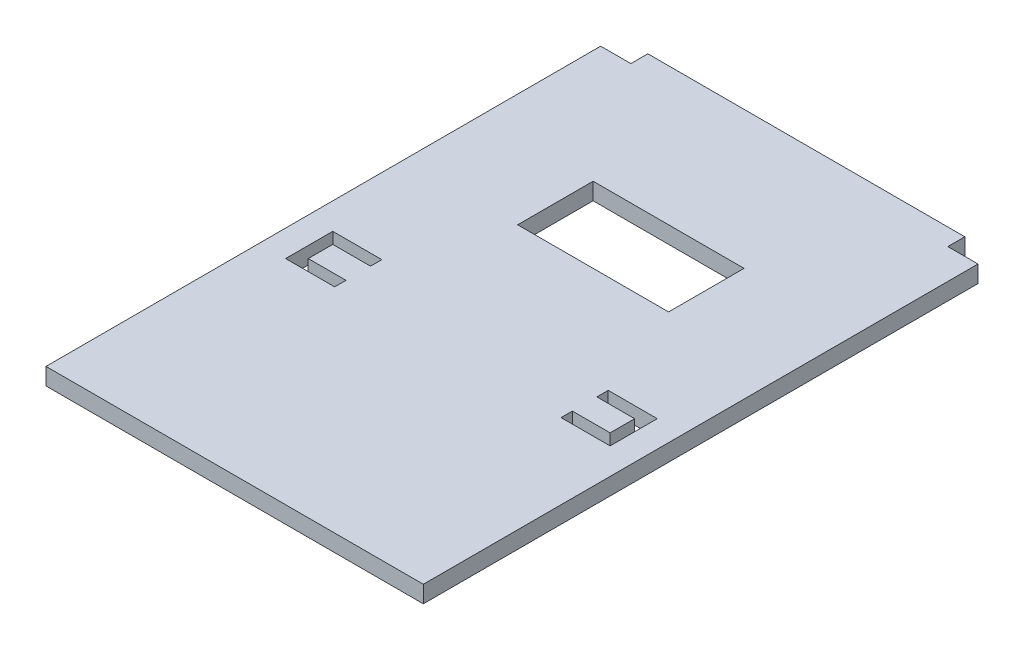
ISO-10303-21;
HEADER;
FILE_DESCRIPTION(('STEP AP214'),'2;1');
FILE_NAME('part.step','',(''),(''),'','','');
FILE_SCHEMA(('AUTOMOTIVE_DESIGN { 1 0 10303 214 1 1 1 1 }'));
ENDSEC;
DATA;
#1=APPLICATION_CONTEXT('core data for automotive mechanical design processes');
#2=APPLICATION_PROTOCOL_DEFINITION('international standard','automotive_design',2000,#1);
#3=PRODUCT_CONTEXT('',#1,'mechanical');
#4=PRODUCT('Part','Part','',(#3));
#5=PRODUCT_RELATED_PRODUCT_CATEGORY('part','',(#4));
#6=PRODUCT_DEFINITION_FORMATION('','',#4);
#7=PRODUCT_DEFINITION_CONTEXT('part definition',#1,'design');
#8=PRODUCT_DEFINITION('design','',#6,#7);
#9=PRODUCT_DEFINITION_SHAPE('','',#8);
#10=(LENGTH_UNIT() NAMED_UNIT(*) SI_UNIT(.MILLI.,.METRE.));
#11=(NAMED_UNIT(*) PLANE_ANGLE_UNIT() SI_UNIT($,.RADIAN.));
#12=(NAMED_UNIT(*) SI_UNIT($,.STERADIAN.) SOLID_ANGLE_UNIT());
#13=UNCERTAINTY_MEASURE_WITH_UNIT(LENGTH_MEASURE(1.E-05),#10,'distance_accuracy_value','');
#14=(GEOMETRIC_REPRESENTATION_CONTEXT(3) GLOBAL_UNCERTAINTY_ASSIGNED_CONTEXT((#13)) GLOBAL_UNIT_ASSIGNED_CONTEXT((#10,
#11,#12)) REPRESENTATION_CONTEXT('',''));
#15=CARTESIAN_POINT('',(0.,0.,0.));
#16=DIRECTION('',(0.,0.,1.));
#17=DIRECTION('',(1.,0.,0.));
#18=AXIS2_PLACEMENT_3D('',#15,#16,#17);
#19=CARTESIAN_POINT('',(0.,4.5,0.));
#20=DIRECTION('',(0.,-1.,0.));
#21=DIRECTION('',(0.,0.,-1.));
#22=AXIS2_PLACEMENT_3D('',#19,#20,#21);
#23=PLANE('',#22);
#24=DIRECTION('',(1.,0.,0.));
#25=VECTOR('',#24,1.);
#26=CARTESIAN_POINT('',(30.,4.5,17.));
#27=LINE('',#26,#25);
#28=CARTESIAN_POINT('',(30.,4.5,17.));
#29=VERTEX_POINT('',#28);
#30=CARTESIAN_POINT('',(42.9999999999999,4.5,17.));
#31=VERTEX_POINT('',#30);
#32=EDGE_CURVE('E259',#29,#31,#27,.T.);
#33=ORIENTED_EDGE('',*,*,#32,.F.);
#34=DIRECTION('',(0.,0.,1.));
#35=VECTOR('',#34,1.);
#36=CARTESIAN_POINT('',(30.,4.5,17.));
#37=LINE('',#36,#35);
#38=CARTESIAN_POINT('',(30.,4.5,14.));
#39=VERTEX_POINT('',#38);
#40=EDGE_CURVE('E275',#39,#29,#37,.T.);
#41=ORIENTED_EDGE('',*,*,#40,.F.);
#42=DIRECTION('',(-1.,0.,0.));
#43=VECTOR('',#42,1.);
#44=CARTESIAN_POINT('',(39.9999999999999,4.5,14.));
#45=LINE('',#44,#43);
#46=CARTESIAN_POINT('',(39.9999999999999,4.5,14.));
#47=VERTEX_POINT('',#46);
#48=EDGE_CURVE('E272',#47,#39,#45,.T.);
#49=ORIENTED_EDGE('',*,*,#48,.F.);
#50=DIRECTION('',(0.,0.,1.));
#51=VECTOR('',#50,1.);
#52=CARTESIAN_POINT('',(39.9999999999999,4.5,7.50000000000001));
#53=LINE('',#52,#51);
#54=CARTESIAN_POINT('',(39.9999999999999,4.5,7.50000000000001));
#55=VERTEX_POINT('',#54);
#56=EDGE_CURVE('E270',#55,#47,#53,.T.);
#57=ORIENTED_EDGE('',*,*,#56,.F.);
#58=DIRECTION('',(1.,0.,0.));
#59=VECTOR('',#58,1.);
#60=CARTESIAN_POINT('',(30.,4.5,7.50000000000001));
#61=LINE('',#60,#59);
#62=CARTESIAN_POINT('',(30.,4.5,7.50000000000001));
#63=VERTEX_POINT('',#62);
#64=EDGE_CURVE('E268',#63,#55,#61,.T.);
#65=ORIENTED_EDGE('',*,*,#64,.F.);
#66=DIRECTION('',(0.,0.,1.));
#67=VECTOR('',#66,1.);
#68=CARTESIAN_POINT('',(30.,4.5,7.50000000000001));
#69=LINE('',#68,#67);
#70=CARTESIAN_POINT('',(30.,4.5,4.50000000000003));
#71=VERTEX_POINT('',#70);
#72=EDGE_CURVE('E266',#71,#63,#69,.T.);
#73=ORIENTED_EDGE('',*,*,#72,.F.);
#74=DIRECTION('',(-1.,0.,0.));
#75=VECTOR('',#74,1.);
#76=CARTESIAN_POINT('',(30.,4.5,4.50000000000003));
#77=LINE('',#76,#75);
#78=CARTESIAN_POINT('',(42.9999999999999,4.5,4.50000000000003));
#79=VERTEX_POINT('',#78);
#80=EDGE_CURVE('E264',#79,#71,#77,.T.);
#81=ORIENTED_EDGE('',*,*,#80,.F.);
#82=DIRECTION('',(0.,0.,-1.));
#83=VECTOR('',#82,1.);
#84=CARTESIAN_POINT('',(42.9999999999999,4.5,4.50000000000003));
#85=LINE('',#84,#83);
#86=EDGE_CURVE('E261',#31,#79,#85,.T.);
#87=ORIENTED_EDGE('',*,*,#86,.F.);
#88=EDGE_LOOP('',(#33,#41,#49,#57,#65,#73,#81,#87));
#89=FACE_BOUND('',#88,.T.);
#90=DIRECTION('',(-1.,0.,0.));
#91=VECTOR('',#90,1.);
#92=CARTESIAN_POINT('',(-42.,4.5,-73.5));
#93=LINE('',#92,#91);
#94=CARTESIAN_POINT('',(-42.,4.5,-73.5));
#95=VERTEX_POINT('',#94);
#96=CARTESIAN_POINT('',(-50.,4.5,-73.5));
#97=VERTEX_POINT('',#96);
#98=EDGE_CURVE('E377',#95,#97,#93,.T.);
#99=ORIENTED_EDGE('',*,*,#98,.T.);
#100=DIRECTION('',(0.,0.,1.));
#101=VECTOR('',#100,1.);
#102=CARTESIAN_POINT('',(-50.,4.5,73.5));
#103=LINE('',#102,#101);
#104=CARTESIAN_POINT('',(-50.,4.5,73.5));
#105=VERTEX_POINT('',#104);
#106=EDGE_CURVE('E380',#97,#105,#103,.T.);
#107=ORIENTED_EDGE('',*,*,#106,.T.);
#108=DIRECTION('',(1.,0.,0.));
#109=VECTOR('',#108,1.);
#110=CARTESIAN_POINT('',(50.,4.5,73.5));
#111=LINE('',#110,#109);
#112=CARTESIAN_POINT('',(50.,4.5,73.5));
#113=VERTEX_POINT('',#112);
#114=EDGE_CURVE('E383',#105,#113,#111,.T.);
#115=ORIENTED_EDGE('',*,*,#114,.T.);
#116=DIRECTION('',(0.,0.,-1.));
#117=VECTOR('',#116,1.);
#118=CARTESIAN_POINT('',(50.,4.5,-73.5));
#119=LINE('',#118,#117);
#120=CARTESIAN_POINT('',(50.,4.5,-73.5));
#121=VERTEX_POINT('',#120);
#122=EDGE_CURVE('E385',#113,#121,#119,.T.);
#123=ORIENTED_EDGE('',*,*,#122,.T.);
#124=DIRECTION('',(-1.,0.,0.));
#125=VECTOR('',#124,1.);
#126=CARTESIAN_POINT('',(50.,4.5,-73.5));
#127=LINE('',#126,#125);
#128=CARTESIAN_POINT('',(42.,4.5,-73.5));
#129=VERTEX_POINT('',#128);
#130=EDGE_CURVE('E387',#121,#129,#127,.T.);
#131=ORIENTED_EDGE('',*,*,#130,.T.);
#132=DIRECTION('',(0.,0.,-1.));
#133=VECTOR('',#132,1.);
#134=CARTESIAN_POINT('',(42.,4.5,-73.5));
#135=LINE('',#134,#133);
#136=CARTESIAN_POINT('',(42.,4.5,-77.9999999999999));
#137=VERTEX_POINT('',#136);
#138=EDGE_CURVE('E389',#129,#137,#135,.T.);
#139=ORIENTED_EDGE('',*,*,#138,.T.);
#140=DIRECTION('',(-1.,0.,0.));
#141=VECTOR('',#140,1.);
#142=CARTESIAN_POINT('',(-42.,4.5,-77.9999999999999));
#143=LINE('',#142,#141);
#144=CARTESIAN_POINT('',(-42.,4.5,-77.9999999999999));
#145=VERTEX_POINT('',#144);
#146=EDGE_CURVE('E391',#137,#145,#143,.T.);
#147=ORIENTED_EDGE('',*,*,#146,.T.);
#148=DIRECTION('',(0.,0.,1.));
#149=VECTOR('',#148,1.);
#150=CARTESIAN_POINT('',(-42.,4.5,-73.5));
#151=LINE('',#150,#149);
#152=EDGE_CURVE('E393',#145,#95,#151,.T.);
#153=ORIENTED_EDGE('',*,*,#152,.T.);
#154=EDGE_LOOP('',(#99,#107,#115,#123,#131,#139,#147,#153));
#155=FACE_BOUND('',#154,.T.);
#156=DIRECTION('',(-1.,0.,0.));
#157=VECTOR('',#156,1.);
#158=CARTESIAN_POINT('',(-43.,4.5,4.50000000000003));
#159=LINE('',#158,#157);
#160=CARTESIAN_POINT('',(-30.,4.5,4.50000000000003));
#161=VERTEX_POINT('',#160);
#162=CARTESIAN_POINT('',(-43.,4.5,4.50000000000003));
#163=VERTEX_POINT('',#162);
#164=EDGE_CURVE('E318',#161,#163,#159,.T.);
#165=ORIENTED_EDGE('',*,*,#164,.F.);
#166=DIRECTION('',(0.,0.,-1.));
#167=VECTOR('',#166,1.);
#168=CARTESIAN_POINT('',(-30.,4.5,4.50000000000003));
#169=LINE('',#168,#167);
#170=CARTESIAN_POINT('',(-30.,4.5,7.50000000000002));
#171=VERTEX_POINT('',#170);
#172=EDGE_CURVE('E334',#171,#161,#169,.T.);
#173=ORIENTED_EDGE('',*,*,#172,.F.);
#174=DIRECTION('',(1.,0.,0.));
#175=VECTOR('',#174,1.);
#176=CARTESIAN_POINT('',(-30.,4.5,7.50000000000002));
#177=LINE('',#176,#175);
#178=CARTESIAN_POINT('',(-40.,4.5,7.50000000000002));
#179=VERTEX_POINT('',#178);
#180=EDGE_CURVE('E331',#179,#171,#177,.T.);
#181=ORIENTED_EDGE('',*,*,#180,.F.);
#182=DIRECTION('',(0.,0.,-1.));
#183=VECTOR('',#182,1.);
#184=CARTESIAN_POINT('',(-40.,4.5,7.50000000000002));
#185=LINE('',#184,#183);
#186=CARTESIAN_POINT('',(-40.,4.5,14.));
#187=VERTEX_POINT('',#186);
#188=EDGE_CURVE('E329',#187,#179,#185,.T.);
#189=ORIENTED_EDGE('',*,*,#188,.F.);
#190=DIRECTION('',(-1.,0.,0.));
#191=VECTOR('',#190,1.);
#192=CARTESIAN_POINT('',(-40.,4.5,14.));
#193=LINE('',#192,#191);
#194=CARTESIAN_POINT('',(-30.,4.5,14.));
#195=VERTEX_POINT('',#194);
#196=EDGE_CURVE('E327',#195,#187,#193,.T.);
#197=ORIENTED_EDGE('',*,*,#196,.F.);
#198=DIRECTION('',(0.,0.,-1.));
#199=VECTOR('',#198,1.);
#200=CARTESIAN_POINT('',(-30.,4.5,14.));
#201=LINE('',#200,#199);
#202=CARTESIAN_POINT('',(-30.,4.5,17.));
#203=VERTEX_POINT('',#202);
#204=EDGE_CURVE('E325',#203,#195,#201,.T.);
#205=ORIENTED_EDGE('',*,*,#204,.F.);
#206=DIRECTION('',(1.,0.,0.));
#207=VECTOR('',#206,1.);
#208=CARTESIAN_POINT('',(-43.,4.5,17.));
#209=LINE('',#208,#207);
#210=CARTESIAN_POINT('',(-43.,4.5,17.));
#211=VERTEX_POINT('',#210);
#212=EDGE_CURVE('E323',#211,#203,#209,.T.);
#213=ORIENTED_EDGE('',*,*,#212,.F.);
#214=DIRECTION('',(0.,0.,1.));
#215=VECTOR('',#214,1.);
#216=CARTESIAN_POINT('',(-43.,4.5,4.50000000000003));
#217=LINE('',#216,#215);
#218=EDGE_CURVE('E320',#163,#211,#217,.T.);
#219=ORIENTED_EDGE('',*,*,#218,.F.);
#220=EDGE_LOOP('',(#165,#173,#181,#189,#197,#205,#213,#219));
#221=FACE_BOUND('',#220,.T.);
#222=DIRECTION('',(-1.,0.,0.));
#223=VECTOR('',#222,1.);
#224=CARTESIAN_POINT('',(-20.,4.5,-41.5));
#225=LINE('',#224,#223);
#226=CARTESIAN_POINT('',(20.,4.5,-41.5));
#227=VERTEX_POINT('',#226);
#228=CARTESIAN_POINT('',(-20.,4.5,-41.5));
#229=VERTEX_POINT('',#228);
#230=EDGE_CURVE('E223',#227,#229,#225,.T.);
#231=ORIENTED_EDGE('',*,*,#230,.F.);
#232=DIRECTION('',(0.,0.,-1.));
#233=VECTOR('',#232,1.);
#234=CARTESIAN_POINT('',(20.,4.5,-41.5));
#235=LINE('',#234,#233);
#236=CARTESIAN_POINT('',(20.,4.5,-21.5));
#237=VERTEX_POINT('',#236);
#238=EDGE_CURVE('E245',#237,#227,#235,.T.);
#239=ORIENTED_EDGE('',*,*,#238,.F.);
#240=DIRECTION('',(1.,0.,0.));
#241=VECTOR('',#240,1.);
#242=CARTESIAN_POINT('',(20.,4.5,-21.5));
#243=LINE('',#242,#241);
#244=CARTESIAN_POINT('',(-20.,4.5,-21.5));
#245=VERTEX_POINT('',#244);
#246=EDGE_CURVE('E243',#245,#237,#243,.T.);
#247=ORIENTED_EDGE('',*,*,#246,.F.);
#248=DIRECTION('',(0.,0.,1.));
#249=VECTOR('',#248,1.);
#250=CARTESIAN_POINT('',(-20.,4.5,-21.5));
#251=LINE('',#250,#249);
#252=EDGE_CURVE('E231',#229,#245,#251,.T.);
#253=ORIENTED_EDGE('',*,*,#252,.F.);
#254=EDGE_LOOP('',(#231,#239,#247,#253));
#255=FACE_BOUND('',#254,.T.);
#256=ADVANCED_FACE('F38',(#89,#155,#221,#255),#23,.F.);
#257=CARTESIAN_POINT('',(0.,0.,0.));
#258=DIRECTION('',(0.,-1.,0.));
#259=DIRECTION('',(0.,0.,-1.));
#260=AXIS2_PLACEMENT_3D('',#257,#258,#259);
#261=PLANE('',#260);
#262=DIRECTION('',(-1.,0.,0.));
#263=VECTOR('',#262,1.);
#264=CARTESIAN_POINT('',(-42.,0.,-73.5));
#265=LINE('',#264,#263);
#266=CARTESIAN_POINT('',(-42.,0.,-73.5));
#267=VERTEX_POINT('',#266);
#268=CARTESIAN_POINT('',(-50.,0.,-73.5));
#269=VERTEX_POINT('',#268);
#270=EDGE_CURVE('E376',#267,#269,#265,.T.);
#271=ORIENTED_EDGE('',*,*,#270,.F.);
#272=DIRECTION('',(0.,0.,1.));
#273=VECTOR('',#272,1.);
#274=CARTESIAN_POINT('',(-42.,0.,-73.5));
#275=LINE('',#274,#273);
#276=CARTESIAN_POINT('',(-42.,0.,-77.9999999999999));
#277=VERTEX_POINT('',#276);
#278=EDGE_CURVE('E381',#277,#267,#275,.T.);
#279=ORIENTED_EDGE('',*,*,#278,.F.);
#280=DIRECTION('',(-1.,0.,0.));
#281=VECTOR('',#280,1.);
#282=CARTESIAN_POINT('',(-42.,0.,-77.9999999999999));
#283=LINE('',#282,#281);
#284=CARTESIAN_POINT('',(42.,0.,-77.9999999999999));
#285=VERTEX_POINT('',#284);
#286=EDGE_CURVE('E408',#285,#277,#283,.T.);
#287=ORIENTED_EDGE('',*,*,#286,.F.);
#288=DIRECTION('',(0.,0.,-1.));
#289=VECTOR('',#288,1.);
#290=CARTESIAN_POINT('',(42.,0.,-73.5));
#291=LINE('',#290,#289);
#292=CARTESIAN_POINT('',(42.,0.,-73.5));
#293=VERTEX_POINT('',#292);
#294=EDGE_CURVE('E406',#293,#285,#291,.T.);
#295=ORIENTED_EDGE('',*,*,#294,.F.);
#296=DIRECTION('',(-1.,0.,0.));
#297=VECTOR('',#296,1.);
#298=CARTESIAN_POINT('',(50.,0.,-73.5));
#299=LINE('',#298,#297);
#300=CARTESIAN_POINT('',(50.,0.,-73.5));
#301=VERTEX_POINT('',#300);
#302=EDGE_CURVE('E404',#301,#293,#299,.T.);
#303=ORIENTED_EDGE('',*,*,#302,.F.);
#304=DIRECTION('',(0.,0.,-1.));
#305=VECTOR('',#304,1.);
#306=CARTESIAN_POINT('',(50.,0.,-73.5));
#307=LINE('',#306,#305);
#308=CARTESIAN_POINT('',(50.,0.,73.5));
#309=VERTEX_POINT('',#308);
#310=EDGE_CURVE('E402',#309,#301,#307,.T.);
#311=ORIENTED_EDGE('',*,*,#310,.F.);
#312=DIRECTION('',(1.,0.,0.));
#313=VECTOR('',#312,1.);
#314=CARTESIAN_POINT('',(50.,0.,73.5));
#315=LINE('',#314,#313);
#316=CARTESIAN_POINT('',(-50.,0.,73.5));
#317=VERTEX_POINT('',#316);
#318=EDGE_CURVE('E400',#317,#309,#315,.T.);
#319=ORIENTED_EDGE('',*,*,#318,.F.);
#320=DIRECTION('',(0.,0.,1.));
#321=VECTOR('',#320,1.);
#322=CARTESIAN_POINT('',(-50.,0.,73.5));
#323=LINE('',#322,#321);
#324=EDGE_CURVE('E398',#269,#317,#323,.T.);
#325=ORIENTED_EDGE('',*,*,#324,.F.);
#326=EDGE_LOOP('',(#271,#279,#287,#295,#303,#311,#319,#325));
#327=FACE_BOUND('',#326,.T.);
#328=DIRECTION('',(0.,0.,-1.));
#329=VECTOR('',#328,1.);
#330=CARTESIAN_POINT('',(-30.,0.,4.50000000000003));
#331=LINE('',#330,#329);
#332=CARTESIAN_POINT('',(-30.,0.,7.50000000000002));
#333=VERTEX_POINT('',#332);
#334=CARTESIAN_POINT('',(-30.,0.,4.50000000000003));
#335=VERTEX_POINT('',#334);
#336=EDGE_CURVE('E321',#333,#335,#331,.T.);
#337=ORIENTED_EDGE('',*,*,#336,.T.);
#338=DIRECTION('',(-1.,0.,0.));
#339=VECTOR('',#338,1.);
#340=CARTESIAN_POINT('',(-43.,0.,4.50000000000003));
#341=LINE('',#340,#339);
#342=CARTESIAN_POINT('',(-43.,0.,4.50000000000003));
#343=VERTEX_POINT('',#342);
#344=EDGE_CURVE('E317',#335,#343,#341,.T.);
#345=ORIENTED_EDGE('',*,*,#344,.T.);
#346=DIRECTION('',(0.,0.,1.));
#347=VECTOR('',#346,1.);
#348=CARTESIAN_POINT('',(-43.,0.,4.50000000000003));
#349=LINE('',#348,#347);
#350=CARTESIAN_POINT('',(-43.,0.,17.));
#351=VERTEX_POINT('',#350);
#352=EDGE_CURVE('E339',#343,#351,#349,.T.);
#353=ORIENTED_EDGE('',*,*,#352,.T.);
#354=DIRECTION('',(1.,0.,0.));
#355=VECTOR('',#354,1.);
#356=CARTESIAN_POINT('',(-43.,0.,17.));
#357=LINE('',#356,#355);
#358=CARTESIAN_POINT('',(-30.,0.,17.));
#359=VERTEX_POINT('',#358);
#360=EDGE_CURVE('E342',#351,#359,#357,.T.);
#361=ORIENTED_EDGE('',*,*,#360,.T.);
#362=DIRECTION('',(0.,0.,-1.));
#363=VECTOR('',#362,1.);
#364=CARTESIAN_POINT('',(-30.,0.,14.));
#365=LINE('',#364,#363);
#366=CARTESIAN_POINT('',(-30.,0.,14.));
#367=VERTEX_POINT('',#366);
#368=EDGE_CURVE('E345',#359,#367,#365,.T.);
#369=ORIENTED_EDGE('',*,*,#368,.T.);
#370=DIRECTION('',(-1.,0.,0.));
#371=VECTOR('',#370,1.);
#372=CARTESIAN_POINT('',(-40.,0.,14.));
#373=LINE('',#372,#371);
#374=CARTESIAN_POINT('',(-40.,0.,14.));
#375=VERTEX_POINT('',#374);
#376=EDGE_CURVE('E348',#367,#375,#373,.T.);
#377=ORIENTED_EDGE('',*,*,#376,.T.);
#378=DIRECTION('',(0.,0.,-1.));
#379=VECTOR('',#378,1.);
#380=CARTESIAN_POINT('',(-40.,0.,7.50000000000002));
#381=LINE('',#380,#379);
#382=CARTESIAN_POINT('',(-40.,0.,7.50000000000002));
#383=VERTEX_POINT('',#382);
#384=EDGE_CURVE('E351',#375,#383,#381,.T.);
#385=ORIENTED_EDGE('',*,*,#384,.T.);
#386=DIRECTION('',(1.,0.,0.));
#387=VECTOR('',#386,1.);
#388=CARTESIAN_POINT('',(-30.,0.,7.50000000000002));
#389=LINE('',#388,#387);
#390=EDGE_CURVE('E354',#383,#333,#389,.T.);
#391=ORIENTED_EDGE('',*,*,#390,.T.);
#392=EDGE_LOOP('',(#337,#345,#353,#361,#369,#377,#385,#391));
#393=FACE_BOUND('',#392,.T.);
#394=DIRECTION('',(0.,0.,1.));
#395=VECTOR('',#394,1.);
#396=CARTESIAN_POINT('',(30.,0.,17.));
#397=LINE('',#396,#395);
#398=CARTESIAN_POINT('',(30.,0.,14.));
#399=VERTEX_POINT('',#398);
#400=CARTESIAN_POINT('',(30.,0.,17.));
#401=VERTEX_POINT('',#400);
#402=EDGE_CURVE('E262',#399,#401,#397,.T.);
#403=ORIENTED_EDGE('',*,*,#402,.T.);
#404=DIRECTION('',(1.,0.,0.));
#405=VECTOR('',#404,1.);
#406=CARTESIAN_POINT('',(30.,0.,17.));
#407=LINE('',#406,#405);
#408=CARTESIAN_POINT('',(42.9999999999999,0.,17.));
#409=VERTEX_POINT('',#408);
#410=EDGE_CURVE('E239',#401,#409,#407,.T.);
#411=ORIENTED_EDGE('',*,*,#410,.T.);
#412=DIRECTION('',(0.,0.,-1.));
#413=VECTOR('',#412,1.);
#414=CARTESIAN_POINT('',(42.9999999999999,0.,4.50000000000003));
#415=LINE('',#414,#413);
#416=CARTESIAN_POINT('',(42.9999999999999,0.,4.50000000000003));
#417=VERTEX_POINT('',#416);
#418=EDGE_CURVE('E280',#409,#417,#415,.T.);
#419=ORIENTED_EDGE('',*,*,#418,.T.);
#420=DIRECTION('',(-1.,0.,0.));
#421=VECTOR('',#420,1.);
#422=CARTESIAN_POINT('',(30.,0.,4.50000000000003));
#423=LINE('',#422,#421);
#424=CARTESIAN_POINT('',(30.,0.,4.50000000000003));
#425=VERTEX_POINT('',#424);
#426=EDGE_CURVE('E283',#417,#425,#423,.T.);
#427=ORIENTED_EDGE('',*,*,#426,.T.);
#428=DIRECTION('',(0.,0.,1.));
#429=VECTOR('',#428,1.);
#430=CARTESIAN_POINT('',(30.,0.,7.50000000000001));
#431=LINE('',#430,#429);
#432=CARTESIAN_POINT('',(30.,0.,7.50000000000001));
#433=VERTEX_POINT('',#432);
#434=EDGE_CURVE('E286',#425,#433,#431,.T.);
#435=ORIENTED_EDGE('',*,*,#434,.T.);
#436=DIRECTION('',(1.,0.,0.));
#437=VECTOR('',#436,1.);
#438=CARTESIAN_POINT('',(30.,0.,7.50000000000001));
#439=LINE('',#438,#437);
#440=CARTESIAN_POINT('',(39.9999999999999,0.,7.50000000000001));
#441=VERTEX_POINT('',#440);
#442=EDGE_CURVE('E289',#433,#441,#439,.T.);
#443=ORIENTED_EDGE('',*,*,#442,.T.);
#444=DIRECTION('',(0.,0.,1.));
#445=VECTOR('',#444,1.);
#446=CARTESIAN_POINT('',(39.9999999999999,0.,7.50000000000001));
#447=LINE('',#446,#445);
#448=CARTESIAN_POINT('',(39.9999999999999,0.,14.));
#449=VERTEX_POINT('',#448);
#450=EDGE_CURVE('E292',#441,#449,#447,.T.);
#451=ORIENTED_EDGE('',*,*,#450,.T.);
#452=DIRECTION('',(-1.,0.,0.));
#453=VECTOR('',#452,1.);
#454=CARTESIAN_POINT('',(39.9999999999999,0.,14.));
#455=LINE('',#454,#453);
#456=EDGE_CURVE('E295',#449,#399,#455,.T.);
#457=ORIENTED_EDGE('',*,*,#456,.T.);
#458=EDGE_LOOP('',(#403,#411,#419,#427,#435,#443,#451,#457));
#459=FACE_BOUND('',#458,.T.);
#460=DIRECTION('',(0.,0.,-1.));
#461=VECTOR('',#460,1.);
#462=CARTESIAN_POINT('',(20.,0.,-41.5));
#463=LINE('',#462,#461);
#464=CARTESIAN_POINT('',(20.,0.,-21.5));
#465=VERTEX_POINT('',#464);
#466=CARTESIAN_POINT('',(20.,0.,-41.5));
#467=VERTEX_POINT('',#466);
#468=EDGE_CURVE('E232',#465,#467,#463,.T.);
#469=ORIENTED_EDGE('',*,*,#468,.T.);
#470=DIRECTION('',(-1.,0.,0.));
#471=VECTOR('',#470,1.);
#472=CARTESIAN_POINT('',(-20.,0.,-41.5));
#473=LINE('',#472,#471);
#474=CARTESIAN_POINT('',(-20.,0.,-41.5));
#475=VERTEX_POINT('',#474);
#476=EDGE_CURVE('E61',#467,#475,#473,.T.);
#477=ORIENTED_EDGE('',*,*,#476,.T.);
#478=DIRECTION('',(0.,0.,1.));
#479=VECTOR('',#478,1.);
#480=CARTESIAN_POINT('',(-20.,0.,-21.5));
#481=LINE('',#480,#479);
#482=CARTESIAN_POINT('',(-20.,0.,-21.5));
#483=VERTEX_POINT('',#482);
#484=EDGE_CURVE('E238',#475,#483,#481,.T.);
#485=ORIENTED_EDGE('',*,*,#484,.T.);
#486=DIRECTION('',(1.,0.,0.));
#487=VECTOR('',#486,1.);
#488=CARTESIAN_POINT('',(20.,0.,-21.5));
#489=LINE('',#488,#487);
#490=EDGE_CURVE('E251',#483,#465,#489,.T.);
#491=ORIENTED_EDGE('',*,*,#490,.T.);
#492=EDGE_LOOP('',(#469,#477,#485,#491));
#493=FACE_BOUND('',#492,.T.);
#494=ADVANCED_FACE('F438',(#327,#393,#459,#493),#261,.T.);
#495=CARTESIAN_POINT('',(-42.,4.5,-73.5));
#496=DIRECTION('',(0.,0.,1.));
#497=DIRECTION('',(1.,0.,0.));
#498=AXIS2_PLACEMENT_3D('',#495,#496,#497);
#499=PLANE('',#498);
#500=ORIENTED_EDGE('',*,*,#270,.T.);
#501=DIRECTION('',(0.,-1.,0.));
#502=VECTOR('',#501,1.);
#503=CARTESIAN_POINT('',(-50.,4.5,-73.5));
#504=LINE('',#503,#502);
#505=EDGE_CURVE('E11',#97,#269,#504,.T.);
#506=ORIENTED_EDGE('',*,*,#505,.F.);
#507=ORIENTED_EDGE('',*,*,#98,.F.);
#508=DIRECTION('',(0.,-1.,0.));
#509=VECTOR('',#508,1.);
#510=CARTESIAN_POINT('',(-42.,4.5,-73.5));
#511=LINE('',#510,#509);
#512=EDGE_CURVE('E395',#95,#267,#511,.T.);
#513=ORIENTED_EDGE('',*,*,#512,.T.);
#514=EDGE_LOOP('',(#500,#506,#507,#513));
#515=FACE_BOUND('',#514,.T.);
#516=ADVANCED_FACE('F40',(#515),#499,.F.);
#517=CARTESIAN_POINT('',(-50.,4.5,73.5));
#518=DIRECTION('',(1.,0.,0.));
#519=DIRECTION('',(0.,0.,-1.));
#520=AXIS2_PLACEMENT_3D('',#517,#518,#519);
#521=PLANE('',#520);
#522=ORIENTED_EDGE('',*,*,#324,.T.);
#523=DIRECTION('',(0.,-1.,0.));
#524=VECTOR('',#523,1.);
#525=CARTESIAN_POINT('',(-50.,4.5,73.5));
#526=LINE('',#525,#524);
#527=EDGE_CURVE('E46',#105,#317,#526,.T.);
#528=ORIENTED_EDGE('',*,*,#527,.F.);
#529=ORIENTED_EDGE('',*,*,#106,.F.);
#530=ORIENTED_EDGE('',*,*,#505,.T.);
#531=EDGE_LOOP('',(#522,#528,#529,#530));
#532=FACE_BOUND('',#531,.T.);
#533=ADVANCED_FACE('F456',(#532),#521,.F.);
#534=CARTESIAN_POINT('',(50.,4.5,73.5));
#535=DIRECTION('',(0.,0.,-1.));
#536=DIRECTION('',(-1.,0.,0.));
#537=AXIS2_PLACEMENT_3D('',#534,#535,#536);
#538=PLANE('',#537);
#539=ORIENTED_EDGE('',*,*,#318,.T.);
#540=DIRECTION('',(0.,-1.,0.));
#541=VECTOR('',#540,1.);
#542=CARTESIAN_POINT('',(50.,4.5,73.5));
#543=LINE('',#542,#541);
#544=EDGE_CURVE('E425',#113,#309,#543,.T.);
#545=ORIENTED_EDGE('',*,*,#544,.F.);
#546=ORIENTED_EDGE('',*,*,#114,.F.);
#547=ORIENTED_EDGE('',*,*,#527,.T.);
#548=EDGE_LOOP('',(#539,#545,#546,#547));
#549=FACE_BOUND('',#548,.T.);
#550=ADVANCED_FACE('F432',(#549),#538,.F.);
#551=CARTESIAN_POINT('',(50.,4.5,-73.5));
#552=DIRECTION('',(-1.,0.,0.));
#553=DIRECTION('',(0.,0.,1.));
#554=AXIS2_PLACEMENT_3D('',#551,#552,#553);
#555=PLANE('',#554);
#556=ORIENTED_EDGE('',*,*,#310,.T.);
#557=DIRECTION('',(0.,-1.,0.));
#558=VECTOR('',#557,1.);
#559=CARTESIAN_POINT('',(50.,4.5,-73.5));
#560=LINE('',#559,#558);
#561=EDGE_CURVE('E422',#121,#301,#560,.T.);
#562=ORIENTED_EDGE('',*,*,#561,.F.);
#563=ORIENTED_EDGE('',*,*,#122,.F.);
#564=ORIENTED_EDGE('',*,*,#544,.T.);
#565=EDGE_LOOP('',(#556,#562,#563,#564));
#566=FACE_BOUND('',#565,.T.);
#567=ADVANCED_FACE('F444',(#566),#555,.F.);
#568=CARTESIAN_POINT('',(50.,4.5,-73.5));
#569=DIRECTION('',(0.,0.,1.));
#570=DIRECTION('',(1.,0.,0.));
#571=AXIS2_PLACEMENT_3D('',#568,#569,#570);
#572=PLANE('',#571);
#573=ORIENTED_EDGE('',*,*,#302,.T.);
#574=DIRECTION('',(0.,-1.,0.));
#575=VECTOR('',#574,1.);
#576=CARTESIAN_POINT('',(42.,4.5,-73.5));
#577=LINE('',#576,#575);
#578=EDGE_CURVE('E419',#129,#293,#577,.T.);
#579=ORIENTED_EDGE('',*,*,#578,.F.);
#580=ORIENTED_EDGE('',*,*,#130,.F.);
#581=ORIENTED_EDGE('',*,*,#561,.T.);
#582=EDGE_LOOP('',(#573,#579,#580,#581));
#583=FACE_BOUND('',#582,.T.);
#584=ADVANCED_FACE('F448',(#583),#572,.F.);
#585=CARTESIAN_POINT('',(42.,4.5,-73.5));
#586=DIRECTION('',(-1.,0.,0.));
#587=DIRECTION('',(0.,0.,1.));
#588=AXIS2_PLACEMENT_3D('',#585,#586,#587);
#589=PLANE('',#588);
#590=ORIENTED_EDGE('',*,*,#294,.T.);
#591=DIRECTION('',(0.,-1.,0.));
#592=VECTOR('',#591,1.);
#593=CARTESIAN_POINT('',(42.,4.5,-77.9999999999999));
#594=LINE('',#593,#592);
#595=EDGE_CURVE('E416',#137,#285,#594,.T.);
#596=ORIENTED_EDGE('',*,*,#595,.F.);
#597=ORIENTED_EDGE('',*,*,#138,.F.);
#598=ORIENTED_EDGE('',*,*,#578,.T.);
#599=EDGE_LOOP('',(#590,#596,#597,#598));
#600=FACE_BOUND('',#599,.T.);
#601=ADVANCED_FACE('F469',(#600),#589,.F.);
#602=CARTESIAN_POINT('',(-42.,4.5,-77.9999999999999));
#603=DIRECTION('',(0.,0.,1.));
#604=DIRECTION('',(1.,0.,0.));
#605=AXIS2_PLACEMENT_3D('',#602,#603,#604);
#606=PLANE('',#605);
#607=ORIENTED_EDGE('',*,*,#286,.T.);
#608=DIRECTION('',(0.,-1.,0.));
#609=VECTOR('',#608,1.);
#610=CARTESIAN_POINT('',(-42.,4.5,-77.9999999999999));
#611=LINE('',#610,#609);
#612=EDGE_CURVE('E413',#145,#277,#611,.T.);
#613=ORIENTED_EDGE('',*,*,#612,.F.);
#614=ORIENTED_EDGE('',*,*,#146,.F.);
#615=ORIENTED_EDGE('',*,*,#595,.T.);
#616=EDGE_LOOP('',(#607,#613,#614,#615));
#617=FACE_BOUND('',#616,.T.);
#618=ADVANCED_FACE('F467',(#617),#606,.F.);
#619=CARTESIAN_POINT('',(-42.,4.5,-73.5));
#620=DIRECTION('',(1.,0.,0.));
#621=DIRECTION('',(0.,0.,-1.));
#622=AXIS2_PLACEMENT_3D('',#619,#620,#621);
#623=PLANE('',#622);
#624=ORIENTED_EDGE('',*,*,#278,.T.);
#625=ORIENTED_EDGE('',*,*,#512,.F.);
#626=ORIENTED_EDGE('',*,*,#152,.F.);
#627=ORIENTED_EDGE('',*,*,#612,.T.);
#628=EDGE_LOOP('',(#624,#625,#626,#627));
#629=FACE_BOUND('',#628,.T.);
#630=ADVANCED_FACE('F462',(#629),#623,.F.);
#631=CARTESIAN_POINT('',(-43.,4.5,4.50000000000003));
#632=DIRECTION('',(0.,0.,1.));
#633=DIRECTION('',(1.,0.,0.));
#634=AXIS2_PLACEMENT_3D('',#631,#632,#633);
#635=PLANE('',#634);
#636=ORIENTED_EDGE('',*,*,#344,.F.);
#637=DIRECTION('',(0.,-1.,0.));
#638=VECTOR('',#637,1.);
#639=CARTESIAN_POINT('',(-30.,4.5,4.50000000000003));
#640=LINE('',#639,#638);
#641=EDGE_CURVE('E336',#161,#335,#640,.T.);
#642=ORIENTED_EDGE('',*,*,#641,.F.);
#643=ORIENTED_EDGE('',*,*,#164,.T.);
#644=DIRECTION('',(0.,-1.,0.));
#645=VECTOR('',#644,1.);
#646=CARTESIAN_POINT('',(-43.,4.5,4.50000000000003));
#647=LINE('',#646,#645);
#648=EDGE_CURVE('E373',#163,#343,#647,.T.);
#649=ORIENTED_EDGE('',*,*,#648,.T.);
#650=EDGE_LOOP('',(#636,#642,#643,#649));
#651=FACE_BOUND('',#650,.T.);
#652=ADVANCED_FACE('F487',(#651),#635,.T.);
#653=CARTESIAN_POINT('',(-43.,4.5,4.50000000000003));
#654=DIRECTION('',(1.,0.,0.));
#655=DIRECTION('',(0.,0.,-1.));
#656=AXIS2_PLACEMENT_3D('',#653,#654,#655);
#657=PLANE('',#656);
#658=ORIENTED_EDGE('',*,*,#352,.F.);
#659=ORIENTED_EDGE('',*,*,#648,.F.);
#660=ORIENTED_EDGE('',*,*,#218,.T.);
#661=DIRECTION('',(0.,-1.,0.));
#662=VECTOR('',#661,1.);
#663=CARTESIAN_POINT('',(-43.,4.5,17.));
#664=LINE('',#663,#662);
#665=EDGE_CURVE('E371',#211,#351,#664,.T.);
#666=ORIENTED_EDGE('',*,*,#665,.T.);
#667=EDGE_LOOP('',(#658,#659,#660,#666));
#668=FACE_BOUND('',#667,.T.);
#669=ADVANCED_FACE('F494',(#668),#657,.T.);
#670=CARTESIAN_POINT('',(-43.,4.5,17.));
#671=DIRECTION('',(0.,0.,-1.));
#672=DIRECTION('',(-1.,0.,0.));
#673=AXIS2_PLACEMENT_3D('',#670,#671,#672);
#674=PLANE('',#673);
#675=ORIENTED_EDGE('',*,*,#360,.F.);
#676=ORIENTED_EDGE('',*,*,#665,.F.);
#677=ORIENTED_EDGE('',*,*,#212,.T.);
#678=DIRECTION('',(0.,-1.,0.));
#679=VECTOR('',#678,1.);
#680=CARTESIAN_POINT('',(-30.,4.5,17.));
#681=LINE('',#680,#679);
#682=EDGE_CURVE('E369',#203,#359,#681,.T.);
#683=ORIENTED_EDGE('',*,*,#682,.T.);
#684=EDGE_LOOP('',(#675,#676,#677,#683));
#685=FACE_BOUND('',#684,.T.);
#686=ADVANCED_FACE('F499',(#685),#674,.T.);
#687=CARTESIAN_POINT('',(-30.,4.5,14.));
#688=DIRECTION('',(-1.,0.,0.));
#689=DIRECTION('',(0.,0.,1.));
#690=AXIS2_PLACEMENT_3D('',#687,#688,#689);
#691=PLANE('',#690);
#692=ORIENTED_EDGE('',*,*,#368,.F.);
#693=ORIENTED_EDGE('',*,*,#682,.F.);
#694=ORIENTED_EDGE('',*,*,#204,.T.);
#695=DIRECTION('',(0.,-1.,0.));
#696=VECTOR('',#695,1.);
#697=CARTESIAN_POINT('',(-30.,4.5,14.));
#698=LINE('',#697,#696);
#699=EDGE_CURVE('E367',#195,#367,#698,.T.);
#700=ORIENTED_EDGE('',*,*,#699,.T.);
#701=EDGE_LOOP('',(#692,#693,#694,#700));
#702=FACE_BOUND('',#701,.T.);
#703=ADVANCED_FACE('F525',(#702),#691,.T.);
#704=CARTESIAN_POINT('',(-40.,4.5,14.));
#705=DIRECTION('',(0.,0.,1.));
#706=DIRECTION('',(1.,0.,0.));
#707=AXIS2_PLACEMENT_3D('',#704,#705,#706);
#708=PLANE('',#707);
#709=ORIENTED_EDGE('',*,*,#376,.F.);
#710=ORIENTED_EDGE('',*,*,#699,.F.);
#711=ORIENTED_EDGE('',*,*,#196,.T.);
#712=DIRECTION('',(0.,-1.,0.));
#713=VECTOR('',#712,1.);
#714=CARTESIAN_POINT('',(-40.,4.5,14.));
#715=LINE('',#714,#713);
#716=EDGE_CURVE('E365',#187,#375,#715,.T.);
#717=ORIENTED_EDGE('',*,*,#716,.T.);
#718=EDGE_LOOP('',(#709,#710,#711,#717));
#719=FACE_BOUND('',#718,.T.);
#720=ADVANCED_FACE('F530',(#719),#708,.T.);
#721=CARTESIAN_POINT('',(-40.,4.5,7.50000000000002));
#722=DIRECTION('',(-1.,0.,0.));
#723=DIRECTION('',(0.,0.,1.));
#724=AXIS2_PLACEMENT_3D('',#721,#722,#723);
#725=PLANE('',#724);
#726=ORIENTED_EDGE('',*,*,#384,.F.);
#727=ORIENTED_EDGE('',*,*,#716,.F.);
#728=ORIENTED_EDGE('',*,*,#188,.T.);
#729=DIRECTION('',(0.,-1.,0.));
#730=VECTOR('',#729,1.);
#731=CARTESIAN_POINT('',(-40.,4.5,7.50000000000002));
#732=LINE('',#731,#730);
#733=EDGE_CURVE('E363',#179,#383,#732,.T.);
#734=ORIENTED_EDGE('',*,*,#733,.T.);
#735=EDGE_LOOP('',(#726,#727,#728,#734));
#736=FACE_BOUND('',#735,.T.);
#737=ADVANCED_FACE('F533',(#736),#725,.T.);
#738=CARTESIAN_POINT('',(-30.,4.5,7.50000000000002));
#739=DIRECTION('',(0.,0.,-1.));
#740=DIRECTION('',(-1.,0.,0.));
#741=AXIS2_PLACEMENT_3D('',#738,#739,#740);
#742=PLANE('',#741);
#743=ORIENTED_EDGE('',*,*,#390,.F.);
#744=ORIENTED_EDGE('',*,*,#733,.F.);
#745=ORIENTED_EDGE('',*,*,#180,.T.);
#746=DIRECTION('',(0.,-1.,0.));
#747=VECTOR('',#746,1.);
#748=CARTESIAN_POINT('',(-30.,4.5,7.50000000000002));
#749=LINE('',#748,#747);
#750=EDGE_CURVE('E361',#171,#333,#749,.T.);
#751=ORIENTED_EDGE('',*,*,#750,.T.);
#752=EDGE_LOOP('',(#743,#744,#745,#751));
#753=FACE_BOUND('',#752,.T.);
#754=ADVANCED_FACE('F513',(#753),#742,.T.);
#755=CARTESIAN_POINT('',(-30.,4.5,4.50000000000003));
#756=DIRECTION('',(-1.,0.,0.));
#757=DIRECTION('',(0.,0.,1.));
#758=AXIS2_PLACEMENT_3D('',#755,#756,#757);
#759=PLANE('',#758);
#760=ORIENTED_EDGE('',*,*,#336,.F.);
#761=ORIENTED_EDGE('',*,*,#750,.F.);
#762=ORIENTED_EDGE('',*,*,#172,.T.);
#763=ORIENTED_EDGE('',*,*,#641,.T.);
#764=EDGE_LOOP('',(#760,#761,#762,#763));
#765=FACE_BOUND('',#764,.T.);
#766=ADVANCED_FACE('F506',(#765),#759,.T.);
#767=CARTESIAN_POINT('',(30.,4.5,17.));
#768=DIRECTION('',(0.,0.,-1.));
#769=DIRECTION('',(-1.,0.,0.));
#770=AXIS2_PLACEMENT_3D('',#767,#768,#769);
#771=PLANE('',#770);
#772=ORIENTED_EDGE('',*,*,#410,.F.);
#773=DIRECTION('',(0.,-1.,0.));
#774=VECTOR('',#773,1.);
#775=CARTESIAN_POINT('',(30.,4.5,17.));
#776=LINE('',#775,#774);
#777=EDGE_CURVE('E277',#29,#401,#776,.T.);
#778=ORIENTED_EDGE('',*,*,#777,.F.);
#779=ORIENTED_EDGE('',*,*,#32,.T.);
#780=DIRECTION('',(0.,-1.,0.));
#781=VECTOR('',#780,1.);
#782=CARTESIAN_POINT('',(42.9999999999999,4.5,17.));
#783=LINE('',#782,#781);
#784=EDGE_CURVE('E314',#31,#409,#783,.T.);
#785=ORIENTED_EDGE('',*,*,#784,.T.);
#786=EDGE_LOOP('',(#772,#778,#779,#785));
#787=FACE_BOUND('',#786,.T.);
#788=ADVANCED_FACE('F581',(#787),#771,.T.);
#789=CARTESIAN_POINT('',(42.9999999999999,4.5,4.50000000000003));
#790=DIRECTION('',(-1.,0.,0.));
#791=DIRECTION('',(0.,0.,1.));
#792=AXIS2_PLACEMENT_3D('',#789,#790,#791);
#793=PLANE('',#792);
#794=ORIENTED_EDGE('',*,*,#418,.F.);
#795=ORIENTED_EDGE('',*,*,#784,.F.);
#796=ORIENTED_EDGE('',*,*,#86,.T.);
#797=DIRECTION('',(0.,-1.,0.));
#798=VECTOR('',#797,1.);
#799=CARTESIAN_POINT('',(42.9999999999999,4.5,4.50000000000003));
#800=LINE('',#799,#798);
#801=EDGE_CURVE('E312',#79,#417,#800,.T.);
#802=ORIENTED_EDGE('',*,*,#801,.T.);
#803=EDGE_LOOP('',(#794,#795,#796,#802));
#804=FACE_BOUND('',#803,.T.);
#805=ADVANCED_FACE('F590',(#804),#793,.T.);
#806=CARTESIAN_POINT('',(30.,4.5,4.50000000000003));
#807=DIRECTION('',(0.,0.,1.));
#808=DIRECTION('',(1.,0.,0.));
#809=AXIS2_PLACEMENT_3D('',#806,#807,#808);
#810=PLANE('',#809);
#811=ORIENTED_EDGE('',*,*,#426,.F.);
#812=ORIENTED_EDGE('',*,*,#801,.F.);
#813=ORIENTED_EDGE('',*,*,#80,.T.);
#814=DIRECTION('',(0.,-1.,0.));
#815=VECTOR('',#814,1.);
#816=CARTESIAN_POINT('',(30.,4.5,4.50000000000003));
#817=LINE('',#816,#815);
#818=EDGE_CURVE('E310',#71,#425,#817,.T.);
#819=ORIENTED_EDGE('',*,*,#818,.T.);
#820=EDGE_LOOP('',(#811,#812,#813,#819));
#821=FACE_BOUND('',#820,.T.);
#822=ADVANCED_FACE('F601',(#821),#810,.T.);
#823=CARTESIAN_POINT('',(30.,4.5,7.50000000000001));
#824=DIRECTION('',(1.,0.,0.));
#825=DIRECTION('',(0.,0.,-1.));
#826=AXIS2_PLACEMENT_3D('',#823,#824,#825);
#827=PLANE('',#826);
#828=ORIENTED_EDGE('',*,*,#434,.F.);
#829=ORIENTED_EDGE('',*,*,#818,.F.);
#830=ORIENTED_EDGE('',*,*,#72,.T.);
#831=DIRECTION('',(0.,-1.,0.));
#832=VECTOR('',#831,1.);
#833=CARTESIAN_POINT('',(30.,4.5,7.50000000000001));
#834=LINE('',#833,#832);
#835=EDGE_CURVE('E308',#63,#433,#834,.T.);
#836=ORIENTED_EDGE('',*,*,#835,.T.);
#837=EDGE_LOOP('',(#828,#829,#830,#836));
#838=FACE_BOUND('',#837,.T.);
#839=ADVANCED_FACE('F612',(#838),#827,.T.);
#840=CARTESIAN_POINT('',(30.,4.5,7.50000000000001));
#841=DIRECTION('',(0.,0.,-1.));
#842=DIRECTION('',(-1.,0.,0.));
#843=AXIS2_PLACEMENT_3D('',#840,#841,#842);
#844=PLANE('',#843);
#845=ORIENTED_EDGE('',*,*,#442,.F.);
#846=ORIENTED_EDGE('',*,*,#835,.F.);
#847=ORIENTED_EDGE('',*,*,#64,.T.);
#848=DIRECTION('',(0.,-1.,0.));
#849=VECTOR('',#848,1.);
#850=CARTESIAN_POINT('',(39.9999999999999,4.5,7.50000000000001));
#851=LINE('',#850,#849);
#852=EDGE_CURVE('E306',#55,#441,#851,.T.);
#853=ORIENTED_EDGE('',*,*,#852,.T.);
#854=EDGE_LOOP('',(#845,#846,#847,#853));
#855=FACE_BOUND('',#854,.T.);
#856=ADVANCED_FACE('F623',(#855),#844,.T.);
#857=CARTESIAN_POINT('',(39.9999999999999,4.5,7.50000000000001));
#858=DIRECTION('',(1.,0.,0.));
#859=DIRECTION('',(0.,0.,-1.));
#860=AXIS2_PLACEMENT_3D('',#857,#858,#859);
#861=PLANE('',#860);
#862=ORIENTED_EDGE('',*,*,#450,.F.);
#863=ORIENTED_EDGE('',*,*,#852,.F.);
#864=ORIENTED_EDGE('',*,*,#56,.T.);
#865=DIRECTION('',(0.,-1.,0.));
#866=VECTOR('',#865,1.);
#867=CARTESIAN_POINT('',(39.9999999999999,4.5,14.));
#868=LINE('',#867,#866);
#869=EDGE_CURVE('E304',#47,#449,#868,.T.);
#870=ORIENTED_EDGE('',*,*,#869,.T.);
#871=EDGE_LOOP('',(#862,#863,#864,#870));
#872=FACE_BOUND('',#871,.T.);
#873=ADVANCED_FACE('F634',(#872),#861,.T.);
#874=CARTESIAN_POINT('',(39.9999999999999,4.5,14.));
#875=DIRECTION('',(0.,0.,1.));
#876=DIRECTION('',(1.,0.,0.));
#877=AXIS2_PLACEMENT_3D('',#874,#875,#876);
#878=PLANE('',#877);
#879=ORIENTED_EDGE('',*,*,#456,.F.);
#880=ORIENTED_EDGE('',*,*,#869,.F.);
#881=ORIENTED_EDGE('',*,*,#48,.T.);
#882=DIRECTION('',(0.,-1.,0.));
#883=VECTOR('',#882,1.);
#884=CARTESIAN_POINT('',(30.,4.5,14.));
#885=LINE('',#884,#883);
#886=EDGE_CURVE('E302',#39,#399,#885,.T.);
#887=ORIENTED_EDGE('',*,*,#886,.T.);
#888=EDGE_LOOP('',(#879,#880,#881,#887));
#889=FACE_BOUND('',#888,.T.);
#890=ADVANCED_FACE('F645',(#889),#878,.T.);
#891=CARTESIAN_POINT('',(30.,4.5,17.));
#892=DIRECTION('',(1.,0.,0.));
#893=DIRECTION('',(0.,0.,-1.));
#894=AXIS2_PLACEMENT_3D('',#891,#892,#893);
#895=PLANE('',#894);
#896=ORIENTED_EDGE('',*,*,#402,.F.);
#897=ORIENTED_EDGE('',*,*,#886,.F.);
#898=ORIENTED_EDGE('',*,*,#40,.T.);
#899=ORIENTED_EDGE('',*,*,#777,.T.);
#900=EDGE_LOOP('',(#896,#897,#898,#899));
#901=FACE_BOUND('',#900,.T.);
#902=ADVANCED_FACE('F656',(#901),#895,.T.);
#903=CARTESIAN_POINT('',(-20.,4.5,-41.5));
#904=DIRECTION('',(0.,0.,1.));
#905=DIRECTION('',(1.,0.,0.));
#906=AXIS2_PLACEMENT_3D('',#903,#904,#905);
#907=PLANE('',#906);
#908=ORIENTED_EDGE('',*,*,#476,.F.);
#909=DIRECTION('',(0.,-1.,0.));
#910=VECTOR('',#909,1.);
#911=CARTESIAN_POINT('',(20.,4.5,-41.5));
#912=LINE('',#911,#910);
#913=EDGE_CURVE('E227',#227,#467,#912,.T.);
#914=ORIENTED_EDGE('',*,*,#913,.F.);
#915=ORIENTED_EDGE('',*,*,#230,.T.);
#916=DIRECTION('',(0.,-1.,0.));
#917=VECTOR('',#916,1.);
#918=CARTESIAN_POINT('',(-20.,4.5,-41.5));
#919=LINE('',#918,#917);
#920=EDGE_CURVE('E226',#229,#475,#919,.T.);
#921=ORIENTED_EDGE('',*,*,#920,.T.);
#922=EDGE_LOOP('',(#908,#914,#915,#921));
#923=FACE_BOUND('',#922,.T.);
#924=ADVANCED_FACE('F225',(#923),#907,.T.);
#925=CARTESIAN_POINT('',(-20.,4.5,-21.5));
#926=DIRECTION('',(1.,0.,0.));
#927=DIRECTION('',(0.,0.,-1.));
#928=AXIS2_PLACEMENT_3D('',#925,#926,#927);
#929=PLANE('',#928);
#930=ORIENTED_EDGE('',*,*,#484,.F.);
#931=ORIENTED_EDGE('',*,*,#920,.F.);
#932=ORIENTED_EDGE('',*,*,#252,.T.);
#933=DIRECTION('',(0.,-1.,0.));
#934=VECTOR('',#933,1.);
#935=CARTESIAN_POINT('',(-20.,4.5,-21.5));
#936=LINE('',#935,#934);
#937=EDGE_CURVE('E240',#245,#483,#936,.T.);
#938=ORIENTED_EDGE('',*,*,#937,.T.);
#939=EDGE_LOOP('',(#930,#931,#932,#938));
#940=FACE_BOUND('',#939,.T.);
#941=ADVANCED_FACE('F235',(#940),#929,.T.);
#942=CARTESIAN_POINT('',(20.,4.5,-21.5));
#943=DIRECTION('',(0.,0.,-1.));
#944=DIRECTION('',(-1.,0.,0.));
#945=AXIS2_PLACEMENT_3D('',#942,#943,#944);
#946=PLANE('',#945);
#947=ORIENTED_EDGE('',*,*,#490,.F.);
#948=ORIENTED_EDGE('',*,*,#937,.F.);
#949=ORIENTED_EDGE('',*,*,#246,.T.);
#950=DIRECTION('',(0.,-1.,0.));
#951=VECTOR('',#950,1.);
#952=CARTESIAN_POINT('',(20.,4.5,-21.5));
#953=LINE('',#952,#951);
#954=EDGE_CURVE('E53',#237,#465,#953,.T.);
#955=ORIENTED_EDGE('',*,*,#954,.T.);
#956=EDGE_LOOP('',(#947,#948,#949,#955));
#957=FACE_BOUND('',#956,.T.);
#958=ADVANCED_FACE('F686',(#957),#946,.T.);
#959=CARTESIAN_POINT('',(20.,4.5,-41.5));
#960=DIRECTION('',(-1.,0.,0.));
#961=DIRECTION('',(0.,0.,1.));
#962=AXIS2_PLACEMENT_3D('',#959,#960,#961);
#963=PLANE('',#962);
#964=ORIENTED_EDGE('',*,*,#468,.F.);
#965=ORIENTED_EDGE('',*,*,#954,.F.);
#966=ORIENTED_EDGE('',*,*,#238,.T.);
#967=ORIENTED_EDGE('',*,*,#913,.T.);
#968=EDGE_LOOP('',(#964,#965,#966,#967));
#969=FACE_BOUND('',#968,.T.);
#970=ADVANCED_FACE('F696',(#969),#963,.T.);
#971=CLOSED_SHELL('',(#256,#494,#516,#533,#550,#567,#584,#601,#618,#630,#652,#669,#686,#703,
#720,#737,#754,#766,#788,#805,#822,#839,#856,#873,#890,#902,#924,#941,#958,#970));
#972=MANIFOLD_SOLID_BREP('B2',#971);
#973=ADVANCED_BREP_SHAPE_REPRESENTATION('',(#18,#972),#14);
#974=SHAPE_DEFINITION_REPRESENTATION(#9,#973);
ENDSEC;
END-ISO-10303-21;
